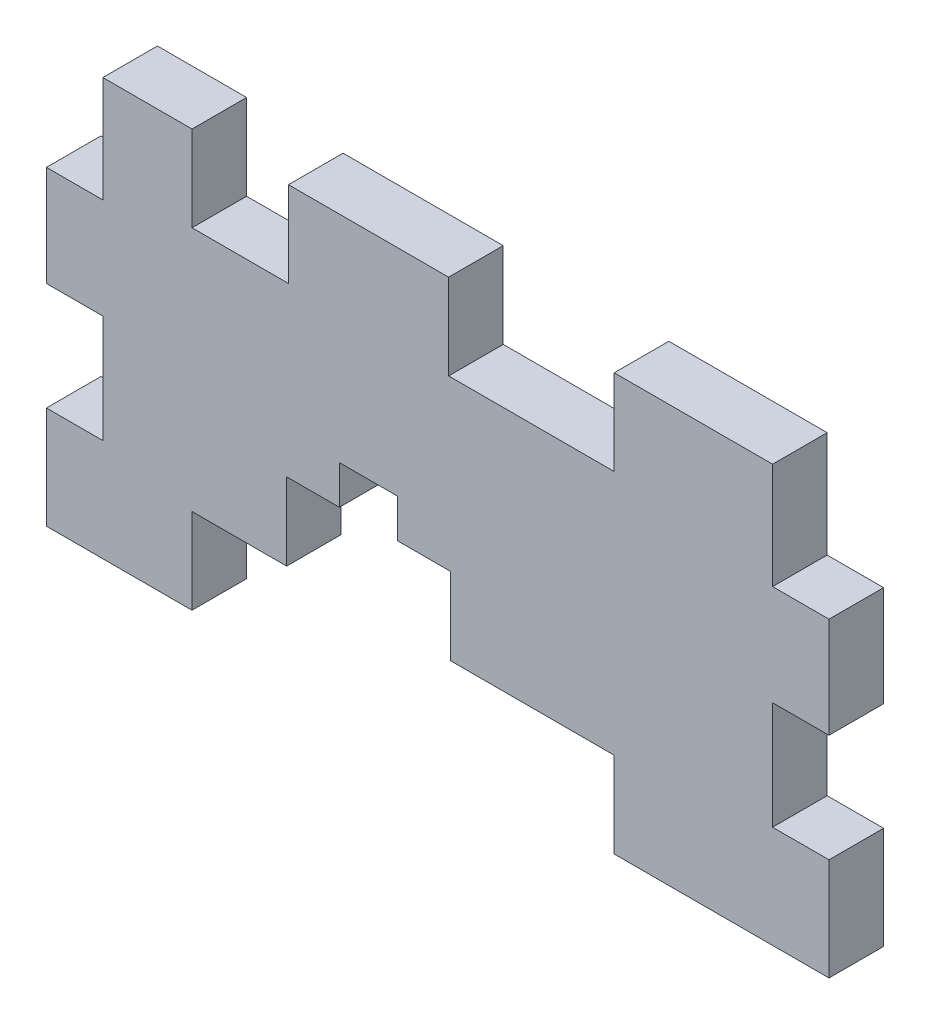
ISO-10303-21;
HEADER;
FILE_DESCRIPTION(('STEP AP214'),'2;1');
FILE_NAME('part.step','',(''),(''),'','','');
FILE_SCHEMA(('AUTOMOTIVE_DESIGN { 1 0 10303 214 1 1 1 1 }'));
ENDSEC;
DATA;
#1=APPLICATION_CONTEXT('core data for automotive mechanical design processes');
#2=APPLICATION_PROTOCOL_DEFINITION('international standard','automotive_design',2000,#1);
#3=PRODUCT_CONTEXT('',#1,'mechanical');
#4=PRODUCT('Part','Part','',(#3));
#5=PRODUCT_RELATED_PRODUCT_CATEGORY('part','',(#4));
#6=PRODUCT_DEFINITION_FORMATION('','',#4);
#7=PRODUCT_DEFINITION_CONTEXT('part definition',#1,'design');
#8=PRODUCT_DEFINITION('design','',#6,#7);
#9=PRODUCT_DEFINITION_SHAPE('','',#8);
#10=(LENGTH_UNIT() NAMED_UNIT(*) SI_UNIT(.MILLI.,.METRE.));
#11=(NAMED_UNIT(*) PLANE_ANGLE_UNIT() SI_UNIT($,.RADIAN.));
#12=(NAMED_UNIT(*) SI_UNIT($,.STERADIAN.) SOLID_ANGLE_UNIT());
#13=UNCERTAINTY_MEASURE_WITH_UNIT(LENGTH_MEASURE(1.E-05),#10,'distance_accuracy_value','');
#14=(GEOMETRIC_REPRESENTATION_CONTEXT(3) GLOBAL_UNCERTAINTY_ASSIGNED_CONTEXT((#13)) GLOBAL_UNIT_ASSIGNED_CONTEXT((#10,
#11,#12)) REPRESENTATION_CONTEXT('',''));
#15=CARTESIAN_POINT('',(0.,0.,0.));
#16=DIRECTION('',(0.,0.,1.));
#17=DIRECTION('',(1.,0.,0.));
#18=AXIS2_PLACEMENT_3D('',#15,#16,#17);
#19=CARTESIAN_POINT('',(0.,0.,2.99999999999996));
#20=DIRECTION('',(0.,0.,-1.));
#21=DIRECTION('',(-1.,0.,0.));
#22=AXIS2_PLACEMENT_3D('',#19,#20,#21);
#23=PLANE('',#22);
#24=DIRECTION('',(0.,-1.,0.));
#25=VECTOR('',#24,1.);
#26=CARTESIAN_POINT('',(-5.39999999999997,26.125,2.99999999999996));
#27=LINE('',#26,#25);
#28=CARTESIAN_POINT('',(-5.39999999999997,26.125,2.99999999999996));
#29=VERTEX_POINT('',#28);
#30=CARTESIAN_POINT('',(-5.39999999999997,24.,2.99999999999996));
#31=VERTEX_POINT('',#30);
#32=EDGE_CURVE('E277',#29,#31,#27,.T.);
#33=ORIENTED_EDGE('',*,*,#32,.F.);
#34=DIRECTION('',(-1.,0.,0.));
#35=VECTOR('',#34,1.);
#36=CARTESIAN_POINT('',(-2.19999999999997,26.125,2.99999999999996));
#37=LINE('',#36,#35);
#38=CARTESIAN_POINT('',(-2.19999999999997,26.125,2.99999999999996));
#39=VERTEX_POINT('',#38);
#40=EDGE_CURVE('E267',#39,#29,#37,.T.);
#41=ORIENTED_EDGE('',*,*,#40,.F.);
#42=DIRECTION('',(0.,1.,0.));
#43=VECTOR('',#42,1.);
#44=CARTESIAN_POINT('',(-2.19999999999997,23.9,2.99999999999996));
#45=LINE('',#44,#43);
#46=CARTESIAN_POINT('',(-2.19999999999997,24.,2.99999999999996));
#47=VERTEX_POINT('',#46);
#48=EDGE_CURVE('E289',#47,#39,#45,.T.);
#49=ORIENTED_EDGE('',*,*,#48,.F.);
#50=DIRECTION('',(1.,0.,0.));
#51=VECTOR('',#50,1.);
#52=CARTESIAN_POINT('',(0.700000000000004,24.,2.99999999999996));
#53=LINE('',#52,#51);
#54=CARTESIAN_POINT('',(0.700000000000004,24.,2.99999999999996));
#55=VERTEX_POINT('',#54);
#56=EDGE_CURVE('E445',#47,#55,#53,.T.);
#57=ORIENTED_EDGE('',*,*,#56,.T.);
#58=DIRECTION('',(0.,-1.,0.));
#59=VECTOR('',#58,1.);
#60=CARTESIAN_POINT('',(0.700000000000004,15.05,2.99999999999996));
#61=LINE('',#60,#59);
#62=CARTESIAN_POINT('',(0.700000000000004,19.75,2.99999999999996));
#63=VERTEX_POINT('',#62);
#64=EDGE_CURVE('E447',#55,#63,#61,.T.);
#65=ORIENTED_EDGE('',*,*,#64,.T.);
#66=DIRECTION('',(-1.,0.,0.));
#67=VECTOR('',#66,1.);
#68=CARTESIAN_POINT('',(9.70000000000001,19.75,2.99999999999996));
#69=LINE('',#68,#67);
#70=CARTESIAN_POINT('',(9.70000000000001,19.75,2.99999999999996));
#71=VERTEX_POINT('',#70);
#72=EDGE_CURVE('E374',#71,#63,#69,.T.);
#73=ORIENTED_EDGE('',*,*,#72,.F.);
#74=DIRECTION('',(0.,1.,0.));
#75=VECTOR('',#74,1.);
#76=CARTESIAN_POINT('',(9.70000000000001,14.95,2.99999999999996));
#77=LINE('',#76,#75);
#78=CARTESIAN_POINT('',(9.70000000000001,15.05,2.99999999999996));
#79=VERTEX_POINT('',#78);
#80=EDGE_CURVE('E370',#79,#71,#77,.T.);
#81=ORIENTED_EDGE('',*,*,#80,.F.);
#82=DIRECTION('',(1.,0.,0.));
#83=VECTOR('',#82,1.);
#84=CARTESIAN_POINT('',(21.5,15.05,2.99999999999996));
#85=LINE('',#84,#83);
#86=CARTESIAN_POINT('',(21.5,15.05,2.99999999999996));
#87=VERTEX_POINT('',#86);
#88=EDGE_CURVE('E450',#79,#87,#85,.T.);
#89=ORIENTED_EDGE('',*,*,#88,.T.);
#90=DIRECTION('',(0.,1.,0.));
#91=VECTOR('',#90,1.);
#92=CARTESIAN_POINT('',(21.5,37.95,2.99999999999996));
#93=LINE('',#92,#91);
#94=CARTESIAN_POINT('',(21.5,20.675,2.99999999999996));
#95=VERTEX_POINT('',#94);
#96=EDGE_CURVE('E428',#87,#95,#93,.T.);
#97=ORIENTED_EDGE('',*,*,#96,.T.);
#98=DIRECTION('',(1.,0.,0.));
#99=VECTOR('',#98,1.);
#100=CARTESIAN_POINT('',(18.4,20.675,2.99999999999996));
#101=LINE('',#100,#99);
#102=CARTESIAN_POINT('',(18.4,20.675,2.99999999999996));
#103=VERTEX_POINT('',#102);
#104=EDGE_CURVE('E413',#103,#95,#101,.T.);
#105=ORIENTED_EDGE('',*,*,#104,.F.);
#106=DIRECTION('',(0.,-1.,0.));
#107=VECTOR('',#106,1.);
#108=CARTESIAN_POINT('',(18.4,26.6,2.99999999999996));
#109=LINE('',#108,#107);
#110=CARTESIAN_POINT('',(18.4,26.6,2.99999999999996));
#111=VERTEX_POINT('',#110);
#112=EDGE_CURVE('E410',#111,#103,#109,.T.);
#113=ORIENTED_EDGE('',*,*,#112,.F.);
#114=DIRECTION('',(-1.,0.,0.));
#115=VECTOR('',#114,1.);
#116=CARTESIAN_POINT('',(21.6,26.6,2.99999999999996));
#117=LINE('',#116,#115);
#118=CARTESIAN_POINT('',(21.5,26.6,2.99999999999996));
#119=VERTEX_POINT('',#118);
#120=EDGE_CURVE('E408',#119,#111,#117,.T.);
#121=ORIENTED_EDGE('',*,*,#120,.F.);
#122=CARTESIAN_POINT('',(21.5,32.125,2.99999999999996));
#123=VERTEX_POINT('',#122);
#124=EDGE_CURVE('E432',#119,#123,#93,.T.);
#125=ORIENTED_EDGE('',*,*,#124,.T.);
#126=DIRECTION('',(1.,0.,0.));
#127=VECTOR('',#126,1.);
#128=CARTESIAN_POINT('',(18.4,32.125,2.99999999999996));
#129=LINE('',#128,#127);
#130=CARTESIAN_POINT('',(18.4,32.125,2.99999999999996));
#131=VERTEX_POINT('',#130);
#132=EDGE_CURVE('E396',#131,#123,#129,.T.);
#133=ORIENTED_EDGE('',*,*,#132,.F.);
#134=DIRECTION('',(0.,-1.,0.));
#135=VECTOR('',#134,1.);
#136=CARTESIAN_POINT('',(18.4,38.05,2.99999999999996));
#137=LINE('',#136,#135);
#138=CARTESIAN_POINT('',(18.4,37.95,2.99999999999996));
#139=VERTEX_POINT('',#138);
#140=EDGE_CURVE('E394',#139,#131,#137,.T.);
#141=ORIENTED_EDGE('',*,*,#140,.F.);
#142=DIRECTION('',(-1.,0.,0.));
#143=VECTOR('',#142,1.);
#144=CARTESIAN_POINT('',(21.5,37.95,2.99999999999996));
#145=LINE('',#144,#143);
#146=CARTESIAN_POINT('',(9.70000000000001,37.95,2.99999999999996));
#147=VERTEX_POINT('',#146);
#148=EDGE_CURVE('E433',#139,#147,#145,.T.);
#149=ORIENTED_EDGE('',*,*,#148,.T.);
#150=DIRECTION('',(0.,1.,0.));
#151=VECTOR('',#150,1.);
#152=CARTESIAN_POINT('',(9.70000000000001,33.25,2.99999999999996));
#153=LINE('',#152,#151);
#154=CARTESIAN_POINT('',(9.70000000000001,33.25,2.99999999999996));
#155=VERTEX_POINT('',#154);
#156=EDGE_CURVE('E351',#155,#147,#153,.T.);
#157=ORIENTED_EDGE('',*,*,#156,.F.);
#158=DIRECTION('',(1.,0.,0.));
#159=VECTOR('',#158,1.);
#160=CARTESIAN_POINT('',(0.600000000000004,33.25,2.99999999999996));
#161=LINE('',#160,#159);
#162=CARTESIAN_POINT('',(0.600000000000004,33.25,2.99999999999996));
#163=VERTEX_POINT('',#162);
#164=EDGE_CURVE('E356',#163,#155,#161,.T.);
#165=ORIENTED_EDGE('',*,*,#164,.F.);
#166=DIRECTION('',(0.,-1.,0.));
#167=VECTOR('',#166,1.);
#168=CARTESIAN_POINT('',(0.600000000000004,38.05,2.99999999999996));
#169=LINE('',#168,#167);
#170=CARTESIAN_POINT('',(0.600000000000004,37.95,2.99999999999996));
#171=VERTEX_POINT('',#170);
#172=EDGE_CURVE('E353',#171,#163,#169,.T.);
#173=ORIENTED_EDGE('',*,*,#172,.F.);
#174=CARTESIAN_POINT('',(-8.19999999999995,37.95,2.99999999999996));
#175=VERTEX_POINT('',#174);
#176=EDGE_CURVE('E437',#171,#175,#145,.T.);
#177=ORIENTED_EDGE('',*,*,#176,.T.);
#178=DIRECTION('',(0.,1.,0.));
#179=VECTOR('',#178,1.);
#180=CARTESIAN_POINT('',(-8.19999999999995,33.25,2.99999999999996));
#181=LINE('',#180,#179);
#182=CARTESIAN_POINT('',(-8.19999999999995,33.25,2.99999999999996));
#183=VERTEX_POINT('',#182);
#184=EDGE_CURVE('E56',#183,#175,#181,.T.);
#185=ORIENTED_EDGE('',*,*,#184,.F.);
#186=DIRECTION('',(1.,0.,0.));
#187=VECTOR('',#186,1.);
#188=CARTESIAN_POINT('',(-13.5,33.25,2.99999999999996));
#189=LINE('',#188,#187);
#190=CARTESIAN_POINT('',(-13.5,33.25,2.99999999999996));
#191=VERTEX_POINT('',#190);
#192=EDGE_CURVE('E300',#191,#183,#189,.T.);
#193=ORIENTED_EDGE('',*,*,#192,.F.);
#194=DIRECTION('',(0.,-1.,0.));
#195=VECTOR('',#194,1.);
#196=CARTESIAN_POINT('',(-13.5,38.05,2.99999999999996));
#197=LINE('',#196,#195);
#198=CARTESIAN_POINT('',(-13.5,37.95,2.99999999999996));
#199=VERTEX_POINT('',#198);
#200=EDGE_CURVE('E298',#199,#191,#197,.T.);
#201=ORIENTED_EDGE('',*,*,#200,.F.);
#202=CARTESIAN_POINT('',(-18.4,37.95,2.99999999999996));
#203=VERTEX_POINT('',#202);
#204=EDGE_CURVE('E431',#199,#203,#145,.T.);
#205=ORIENTED_EDGE('',*,*,#204,.T.);
#206=DIRECTION('',(0.,1.,0.));
#207=VECTOR('',#206,1.);
#208=CARTESIAN_POINT('',(-18.4,32.125,2.99999999999996));
#209=LINE('',#208,#207);
#210=CARTESIAN_POINT('',(-18.4,32.125,2.99999999999996));
#211=VERTEX_POINT('',#210);
#212=EDGE_CURVE('E319',#211,#203,#209,.T.);
#213=ORIENTED_EDGE('',*,*,#212,.F.);
#214=DIRECTION('',(1.,0.,0.));
#215=VECTOR('',#214,1.);
#216=CARTESIAN_POINT('',(-21.6,32.125,2.99999999999996));
#217=LINE('',#216,#215);
#218=CARTESIAN_POINT('',(-21.5,32.125,2.99999999999996));
#219=VERTEX_POINT('',#218);
#220=EDGE_CURVE('E317',#219,#211,#217,.T.);
#221=ORIENTED_EDGE('',*,*,#220,.F.);
#222=DIRECTION('',(0.,-1.,0.));
#223=VECTOR('',#222,1.);
#224=CARTESIAN_POINT('',(-21.5,37.95,2.99999999999996));
#225=LINE('',#224,#223);
#226=CARTESIAN_POINT('',(-21.5,26.6,2.99999999999996));
#227=VERTEX_POINT('',#226);
#228=EDGE_CURVE('E438',#219,#227,#225,.T.);
#229=ORIENTED_EDGE('',*,*,#228,.T.);
#230=DIRECTION('',(-1.,0.,0.));
#231=VECTOR('',#230,1.);
#232=CARTESIAN_POINT('',(-18.4,26.6,2.99999999999996));
#233=LINE('',#232,#231);
#234=CARTESIAN_POINT('',(-18.4,26.6,2.99999999999996));
#235=VERTEX_POINT('',#234);
#236=EDGE_CURVE('E332',#235,#227,#233,.T.);
#237=ORIENTED_EDGE('',*,*,#236,.F.);
#238=DIRECTION('',(0.,1.,0.));
#239=VECTOR('',#238,1.);
#240=CARTESIAN_POINT('',(-18.4,20.675,2.99999999999996));
#241=LINE('',#240,#239);
#242=CARTESIAN_POINT('',(-18.4,20.675,2.99999999999996));
#243=VERTEX_POINT('',#242);
#244=EDGE_CURVE('E330',#243,#235,#241,.T.);
#245=ORIENTED_EDGE('',*,*,#244,.F.);
#246=DIRECTION('',(1.,0.,0.));
#247=VECTOR('',#246,1.);
#248=CARTESIAN_POINT('',(-21.6,20.675,2.99999999999996));
#249=LINE('',#248,#247);
#250=CARTESIAN_POINT('',(-21.5,20.675,2.99999999999996));
#251=VERTEX_POINT('',#250);
#252=EDGE_CURVE('E336',#251,#243,#249,.T.);
#253=ORIENTED_EDGE('',*,*,#252,.F.);
#254=CARTESIAN_POINT('',(-21.5,15.05,2.99999999999996));
#255=VERTEX_POINT('',#254);
#256=EDGE_CURVE('E436',#251,#255,#225,.T.);
#257=ORIENTED_EDGE('',*,*,#256,.T.);
#258=DIRECTION('',(1.,0.,0.));
#259=VECTOR('',#258,1.);
#260=CARTESIAN_POINT('',(-8.29999999999995,15.05,2.99999999999996));
#261=LINE('',#260,#259);
#262=CARTESIAN_POINT('',(-13.5,15.05,2.99999999999996));
#263=VERTEX_POINT('',#262);
#264=EDGE_CURVE('E440',#255,#263,#261,.T.);
#265=ORIENTED_EDGE('',*,*,#264,.T.);
#266=DIRECTION('',(0.,-1.,0.));
#267=VECTOR('',#266,1.);
#268=CARTESIAN_POINT('',(-13.5,19.75,2.99999999999996));
#269=LINE('',#268,#267);
#270=CARTESIAN_POINT('',(-13.5,19.75,2.99999999999996));
#271=VERTEX_POINT('',#270);
#272=EDGE_CURVE('E376',#271,#263,#269,.T.);
#273=ORIENTED_EDGE('',*,*,#272,.F.);
#274=CARTESIAN_POINT('',(-8.29999999999995,19.75,2.99999999999996));
#275=VERTEX_POINT('',#274);
#276=EDGE_CURVE('E372',#275,#271,#69,.T.);
#277=ORIENTED_EDGE('',*,*,#276,.F.);
#278=DIRECTION('',(0.,1.,0.));
#279=VECTOR('',#278,1.);
#280=CARTESIAN_POINT('',(-8.29999999999995,24.,2.99999999999996));
#281=LINE('',#280,#279);
#282=CARTESIAN_POINT('',(-8.29999999999995,24.,2.99999999999996));
#283=VERTEX_POINT('',#282);
#284=EDGE_CURVE('E443',#275,#283,#281,.T.);
#285=ORIENTED_EDGE('',*,*,#284,.T.);
#286=EDGE_CURVE('E288',#283,#31,#53,.T.);
#287=ORIENTED_EDGE('',*,*,#286,.T.);
#288=EDGE_LOOP('',(#33,#41,#49,#57,#65,#73,#81,#89,#97,#105,#113,#121,#125,#133,#141,#149,#157,
#165,#173,#177,#185,#193,#201,#205,#213,#221,#229,#237,#245,#253,#257,#265,#273,#277,#285,#287));
#289=FACE_BOUND('',#288,.T.);
#290=ADVANCED_FACE('F33',(#289),#23,.F.);
#291=CARTESIAN_POINT('',(0.,0.,0.));
#292=DIRECTION('',(0.,0.,-1.));
#293=DIRECTION('',(-1.,0.,0.));
#294=AXIS2_PLACEMENT_3D('',#291,#292,#293);
#295=PLANE('',#294);
#296=DIRECTION('',(-1.,0.,0.));
#297=VECTOR('',#296,1.);
#298=CARTESIAN_POINT('',(-2.19999999999997,26.125,0.));
#299=LINE('',#298,#297);
#300=CARTESIAN_POINT('',(-2.19999999999997,26.125,0.));
#301=VERTEX_POINT('',#300);
#302=CARTESIAN_POINT('',(-5.39999999999997,26.125,0.));
#303=VERTEX_POINT('',#302);
#304=EDGE_CURVE('E293',#301,#303,#299,.T.);
#305=ORIENTED_EDGE('',*,*,#304,.T.);
#306=DIRECTION('',(0.,-1.,0.));
#307=VECTOR('',#306,1.);
#308=CARTESIAN_POINT('',(-5.39999999999997,26.125,0.));
#309=LINE('',#308,#307);
#310=CARTESIAN_POINT('',(-5.39999999999997,24.,0.));
#311=VERTEX_POINT('',#310);
#312=EDGE_CURVE('E283',#303,#311,#309,.T.);
#313=ORIENTED_EDGE('',*,*,#312,.T.);
#314=DIRECTION('',(1.,0.,0.));
#315=VECTOR('',#314,1.);
#316=CARTESIAN_POINT('',(0.700000000000004,24.,0.));
#317=LINE('',#316,#315);
#318=CARTESIAN_POINT('',(-8.29999999999995,24.,0.));
#319=VERTEX_POINT('',#318);
#320=EDGE_CURVE('E470',#319,#311,#317,.T.);
#321=ORIENTED_EDGE('',*,*,#320,.F.);
#322=DIRECTION('',(0.,1.,0.));
#323=VECTOR('',#322,1.);
#324=CARTESIAN_POINT('',(-8.29999999999995,24.,0.));
#325=LINE('',#324,#323);
#326=CARTESIAN_POINT('',(-8.29999999999995,19.75,0.));
#327=VERTEX_POINT('',#326);
#328=EDGE_CURVE('E467',#327,#319,#325,.T.);
#329=ORIENTED_EDGE('',*,*,#328,.F.);
#330=DIRECTION('',(-1.,0.,0.));
#331=VECTOR('',#330,1.);
#332=CARTESIAN_POINT('',(9.70000000000001,19.75,0.));
#333=LINE('',#332,#331);
#334=CARTESIAN_POINT('',(-13.5,19.75,0.));
#335=VERTEX_POINT('',#334);
#336=EDGE_CURVE('E381',#327,#335,#333,.T.);
#337=ORIENTED_EDGE('',*,*,#336,.T.);
#338=DIRECTION('',(0.,-1.,0.));
#339=VECTOR('',#338,1.);
#340=CARTESIAN_POINT('',(-13.5,19.75,0.));
#341=LINE('',#340,#339);
#342=CARTESIAN_POINT('',(-13.5,15.05,0.));
#343=VERTEX_POINT('',#342);
#344=EDGE_CURVE('E373',#335,#343,#341,.T.);
#345=ORIENTED_EDGE('',*,*,#344,.T.);
#346=DIRECTION('',(1.,0.,0.));
#347=VECTOR('',#346,1.);
#348=CARTESIAN_POINT('',(-8.29999999999995,15.05,0.));
#349=LINE('',#348,#347);
#350=CARTESIAN_POINT('',(-21.5,15.05,0.));
#351=VERTEX_POINT('',#350);
#352=EDGE_CURVE('E464',#351,#343,#349,.T.);
#353=ORIENTED_EDGE('',*,*,#352,.F.);
#354=DIRECTION('',(0.,-1.,0.));
#355=VECTOR('',#354,1.);
#356=CARTESIAN_POINT('',(-21.5,37.95,0.));
#357=LINE('',#356,#355);
#358=CARTESIAN_POINT('',(-21.5,20.675,0.));
#359=VERTEX_POINT('',#358);
#360=EDGE_CURVE('E460',#359,#351,#357,.T.);
#361=ORIENTED_EDGE('',*,*,#360,.F.);
#362=DIRECTION('',(1.,0.,0.));
#363=VECTOR('',#362,1.);
#364=CARTESIAN_POINT('',(-21.6,20.675,0.));
#365=LINE('',#364,#363);
#366=CARTESIAN_POINT('',(-18.4,20.675,0.));
#367=VERTEX_POINT('',#366);
#368=EDGE_CURVE('E333',#359,#367,#365,.T.);
#369=ORIENTED_EDGE('',*,*,#368,.T.);
#370=DIRECTION('',(0.,1.,0.));
#371=VECTOR('',#370,1.);
#372=CARTESIAN_POINT('',(-18.4,20.675,0.));
#373=LINE('',#372,#371);
#374=CARTESIAN_POINT('',(-18.4,26.6,0.));
#375=VERTEX_POINT('',#374);
#376=EDGE_CURVE('E329',#367,#375,#373,.T.);
#377=ORIENTED_EDGE('',*,*,#376,.T.);
#378=DIRECTION('',(-1.,0.,0.));
#379=VECTOR('',#378,1.);
#380=CARTESIAN_POINT('',(-18.4,26.6,0.));
#381=LINE('',#380,#379);
#382=CARTESIAN_POINT('',(-21.5,26.6,0.));
#383=VERTEX_POINT('',#382);
#384=EDGE_CURVE('E341',#375,#383,#381,.T.);
#385=ORIENTED_EDGE('',*,*,#384,.T.);
#386=CARTESIAN_POINT('',(-21.5,32.125,0.));
#387=VERTEX_POINT('',#386);
#388=EDGE_CURVE('E462',#387,#383,#357,.T.);
#389=ORIENTED_EDGE('',*,*,#388,.F.);
#390=DIRECTION('',(1.,0.,0.));
#391=VECTOR('',#390,1.);
#392=CARTESIAN_POINT('',(-21.6,32.125,0.));
#393=LINE('',#392,#391);
#394=CARTESIAN_POINT('',(-18.4,32.125,0.));
#395=VERTEX_POINT('',#394);
#396=EDGE_CURVE('E316',#387,#395,#393,.T.);
#397=ORIENTED_EDGE('',*,*,#396,.T.);
#398=DIRECTION('',(0.,1.,0.));
#399=VECTOR('',#398,1.);
#400=CARTESIAN_POINT('',(-18.4,32.125,0.));
#401=LINE('',#400,#399);
#402=CARTESIAN_POINT('',(-18.4,37.95,0.));
#403=VERTEX_POINT('',#402);
#404=EDGE_CURVE('E320',#395,#403,#401,.T.);
#405=ORIENTED_EDGE('',*,*,#404,.T.);
#406=DIRECTION('',(-1.,0.,0.));
#407=VECTOR('',#406,1.);
#408=CARTESIAN_POINT('',(21.5,37.95,0.));
#409=LINE('',#408,#407);
#410=CARTESIAN_POINT('',(-13.5,37.95,0.));
#411=VERTEX_POINT('',#410);
#412=EDGE_CURVE('E456',#411,#403,#409,.T.);
#413=ORIENTED_EDGE('',*,*,#412,.F.);
#414=DIRECTION('',(0.,-1.,0.));
#415=VECTOR('',#414,1.);
#416=CARTESIAN_POINT('',(-13.5,38.05,0.));
#417=LINE('',#416,#415);
#418=CARTESIAN_POINT('',(-13.5,33.25,0.));
#419=VERTEX_POINT('',#418);
#420=EDGE_CURVE('E284',#411,#419,#417,.T.);
#421=ORIENTED_EDGE('',*,*,#420,.T.);
#422=DIRECTION('',(1.,0.,0.));
#423=VECTOR('',#422,1.);
#424=CARTESIAN_POINT('',(-13.5,33.25,0.));
#425=LINE('',#424,#423);
#426=CARTESIAN_POINT('',(-8.19999999999995,33.25,0.));
#427=VERTEX_POINT('',#426);
#428=EDGE_CURVE('E307',#419,#427,#425,.T.);
#429=ORIENTED_EDGE('',*,*,#428,.T.);
#430=DIRECTION('',(0.,1.,0.));
#431=VECTOR('',#430,1.);
#432=CARTESIAN_POINT('',(-8.19999999999995,33.25,0.));
#433=LINE('',#432,#431);
#434=CARTESIAN_POINT('',(-8.19999999999995,37.95,0.));
#435=VERTEX_POINT('',#434);
#436=EDGE_CURVE('E301',#427,#435,#433,.T.);
#437=ORIENTED_EDGE('',*,*,#436,.T.);
#438=CARTESIAN_POINT('',(0.600000000000007,37.95,0.));
#439=VERTEX_POINT('',#438);
#440=EDGE_CURVE('E461',#439,#435,#409,.T.);
#441=ORIENTED_EDGE('',*,*,#440,.F.);
#442=DIRECTION('',(0.,-1.,0.));
#443=VECTOR('',#442,1.);
#444=CARTESIAN_POINT('',(0.600000000000004,38.05,0.));
#445=LINE('',#444,#443);
#446=CARTESIAN_POINT('',(0.600000000000004,33.25,0.));
#447=VERTEX_POINT('',#446);
#448=EDGE_CURVE('E361',#439,#447,#445,.T.);
#449=ORIENTED_EDGE('',*,*,#448,.T.);
#450=DIRECTION('',(1.,0.,0.));
#451=VECTOR('',#450,1.);
#452=CARTESIAN_POINT('',(0.600000000000004,33.25,0.));
#453=LINE('',#452,#451);
#454=CARTESIAN_POINT('',(9.70000000000001,33.25,0.));
#455=VERTEX_POINT('',#454);
#456=EDGE_CURVE('E354',#447,#455,#453,.T.);
#457=ORIENTED_EDGE('',*,*,#456,.T.);
#458=DIRECTION('',(0.,1.,0.));
#459=VECTOR('',#458,1.);
#460=CARTESIAN_POINT('',(9.70000000000001,33.25,0.));
#461=LINE('',#460,#459);
#462=CARTESIAN_POINT('',(9.70000000000001,37.95,0.));
#463=VERTEX_POINT('',#462);
#464=EDGE_CURVE('E350',#455,#463,#461,.T.);
#465=ORIENTED_EDGE('',*,*,#464,.T.);
#466=CARTESIAN_POINT('',(18.4,37.95,0.));
#467=VERTEX_POINT('',#466);
#468=EDGE_CURVE('E457',#467,#463,#409,.T.);
#469=ORIENTED_EDGE('',*,*,#468,.F.);
#470=DIRECTION('',(0.,-1.,0.));
#471=VECTOR('',#470,1.);
#472=CARTESIAN_POINT('',(18.4,38.05,0.));
#473=LINE('',#472,#471);
#474=CARTESIAN_POINT('',(18.4,32.125,0.));
#475=VERTEX_POINT('',#474);
#476=EDGE_CURVE('E393',#467,#475,#473,.T.);
#477=ORIENTED_EDGE('',*,*,#476,.T.);
#478=DIRECTION('',(1.,0.,0.));
#479=VECTOR('',#478,1.);
#480=CARTESIAN_POINT('',(18.4,32.125,0.));
#481=LINE('',#480,#479);
#482=CARTESIAN_POINT('',(21.5,32.125,0.));
#483=VERTEX_POINT('',#482);
#484=EDGE_CURVE('E397',#475,#483,#481,.T.);
#485=ORIENTED_EDGE('',*,*,#484,.T.);
#486=DIRECTION('',(0.,1.,0.));
#487=VECTOR('',#486,1.);
#488=CARTESIAN_POINT('',(21.5,37.95,0.));
#489=LINE('',#488,#487);
#490=CARTESIAN_POINT('',(21.5,26.6,0.));
#491=VERTEX_POINT('',#490);
#492=EDGE_CURVE('E427',#491,#483,#489,.T.);
#493=ORIENTED_EDGE('',*,*,#492,.F.);
#494=DIRECTION('',(-1.,0.,0.));
#495=VECTOR('',#494,1.);
#496=CARTESIAN_POINT('',(0.,26.6,0.));
#497=LINE('',#496,#495);
#498=CARTESIAN_POINT('',(18.4,26.6,0.));
#499=VERTEX_POINT('',#498);
#500=EDGE_CURVE('E489',#491,#499,#497,.T.);
#501=ORIENTED_EDGE('',*,*,#500,.T.);
#502=DIRECTION('',(0.,-1.,0.));
#503=VECTOR('',#502,1.);
#504=CARTESIAN_POINT('',(18.4,26.6,0.));
#505=LINE('',#504,#503);
#506=CARTESIAN_POINT('',(18.4,20.675,0.));
#507=VERTEX_POINT('',#506);
#508=EDGE_CURVE('E407',#499,#507,#505,.T.);
#509=ORIENTED_EDGE('',*,*,#508,.T.);
#510=DIRECTION('',(1.,0.,0.));
#511=VECTOR('',#510,1.);
#512=CARTESIAN_POINT('',(18.4,20.675,0.));
#513=LINE('',#512,#511);
#514=CARTESIAN_POINT('',(21.5,20.675,0.));
#515=VERTEX_POINT('',#514);
#516=EDGE_CURVE('E411',#507,#515,#513,.T.);
#517=ORIENTED_EDGE('',*,*,#516,.T.);
#518=CARTESIAN_POINT('',(21.5,15.05,0.));
#519=VERTEX_POINT('',#518);
#520=EDGE_CURVE('E453',#519,#515,#489,.T.);
#521=ORIENTED_EDGE('',*,*,#520,.F.);
#522=DIRECTION('',(1.,0.,0.));
#523=VECTOR('',#522,1.);
#524=CARTESIAN_POINT('',(21.5,15.05,0.));
#525=LINE('',#524,#523);
#526=CARTESIAN_POINT('',(9.70000000000001,15.05,0.));
#527=VERTEX_POINT('',#526);
#528=EDGE_CURVE('E476',#527,#519,#525,.T.);
#529=ORIENTED_EDGE('',*,*,#528,.F.);
#530=DIRECTION('',(0.,1.,0.));
#531=VECTOR('',#530,1.);
#532=CARTESIAN_POINT('',(9.70000000000001,14.95,0.));
#533=LINE('',#532,#531);
#534=CARTESIAN_POINT('',(9.70000000000001,19.75,0.));
#535=VERTEX_POINT('',#534);
#536=EDGE_CURVE('E369',#527,#535,#533,.T.);
#537=ORIENTED_EDGE('',*,*,#536,.T.);
#538=CARTESIAN_POINT('',(0.700000000000004,19.75,0.));
#539=VERTEX_POINT('',#538);
#540=EDGE_CURVE('E382',#535,#539,#333,.T.);
#541=ORIENTED_EDGE('',*,*,#540,.T.);
#542=DIRECTION('',(0.,-1.,0.));
#543=VECTOR('',#542,1.);
#544=CARTESIAN_POINT('',(0.700000000000004,15.05,0.));
#545=LINE('',#544,#543);
#546=CARTESIAN_POINT('',(0.700000000000004,24.,0.));
#547=VERTEX_POINT('',#546);
#548=EDGE_CURVE('E473',#547,#539,#545,.T.);
#549=ORIENTED_EDGE('',*,*,#548,.F.);
#550=CARTESIAN_POINT('',(-2.19999999999997,24.,0.));
#551=VERTEX_POINT('',#550);
#552=EDGE_CURVE('E469',#551,#547,#317,.T.);
#553=ORIENTED_EDGE('',*,*,#552,.F.);
#554=DIRECTION('',(0.,1.,0.));
#555=VECTOR('',#554,1.);
#556=CARTESIAN_POINT('',(-2.19999999999997,23.9,0.));
#557=LINE('',#556,#555);
#558=EDGE_CURVE('E48',#551,#301,#557,.T.);
#559=ORIENTED_EDGE('',*,*,#558,.T.);
#560=EDGE_LOOP('',(#305,#313,#321,#329,#337,#345,#353,#361,#369,#377,#385,#389,#397,#405,#413,
#421,#429,#437,#441,#449,#457,#465,#469,#477,#485,#493,#501,#509,#517,#521,#529,#537,#541,#549,
#553,#559));
#561=FACE_BOUND('',#560,.T.);
#562=ADVANCED_FACE('F539',(#561),#295,.T.);
#563=CARTESIAN_POINT('',(0.700000000000004,24.,2.99999999999996));
#564=DIRECTION('',(0.,1.,0.));
#565=DIRECTION('',(0.,0.,1.));
#566=AXIS2_PLACEMENT_3D('',#563,#564,#565);
#567=PLANE('',#566);
#568=DIRECTION('',(0.,0.,-1.));
#569=VECTOR('',#568,1.);
#570=CARTESIAN_POINT('',(-5.39999999999997,24.,2.99999999999996));
#571=LINE('',#570,#569);
#572=EDGE_CURVE('E11',#31,#311,#571,.T.);
#573=ORIENTED_EDGE('',*,*,#572,.F.);
#574=ORIENTED_EDGE('',*,*,#286,.F.);
#575=DIRECTION('',(0.,0.,-1.));
#576=VECTOR('',#575,1.);
#577=CARTESIAN_POINT('',(-8.29999999999995,24.,2.99999999999996));
#578=LINE('',#577,#576);
#579=EDGE_CURVE('E483',#283,#319,#578,.T.);
#580=ORIENTED_EDGE('',*,*,#579,.T.);
#581=ORIENTED_EDGE('',*,*,#320,.T.);
#582=EDGE_LOOP('',(#573,#574,#580,#581));
#583=FACE_BOUND('',#582,.T.);
#584=ADVANCED_FACE('F638',(#583),#567,.F.);
#585=DIRECTION('',(0.,0.,1.));
#586=VECTOR('',#585,1.);
#587=CARTESIAN_POINT('',(-2.19999999999997,24.,2.99999999999996));
#588=LINE('',#587,#586);
#589=EDGE_CURVE('E41',#551,#47,#588,.T.);
#590=ORIENTED_EDGE('',*,*,#589,.F.);
#591=ORIENTED_EDGE('',*,*,#552,.T.);
#592=DIRECTION('',(0.,0.,-1.));
#593=VECTOR('',#592,1.);
#594=CARTESIAN_POINT('',(0.700000000000004,24.,2.99999999999996));
#595=LINE('',#594,#593);
#596=EDGE_CURVE('E480',#55,#547,#595,.T.);
#597=ORIENTED_EDGE('',*,*,#596,.F.);
#598=ORIENTED_EDGE('',*,*,#56,.F.);
#599=EDGE_LOOP('',(#590,#591,#597,#598));
#600=FACE_BOUND('',#599,.T.);
#601=ADVANCED_FACE('F522',(#600),#567,.F.);
#602=CARTESIAN_POINT('',(21.5,37.95,2.99999999999996));
#603=DIRECTION('',(0.,-1.,0.));
#604=DIRECTION('',(1.,0.,0.));
#605=AXIS2_PLACEMENT_3D('',#602,#603,#604);
#606=PLANE('',#605);
#607=DIRECTION('',(0.,0.,1.));
#608=VECTOR('',#607,1.);
#609=CARTESIAN_POINT('',(-13.5,37.95,2.99999999999996));
#610=LINE('',#609,#608);
#611=EDGE_CURVE('E516',#411,#199,#610,.T.);
#612=ORIENTED_EDGE('',*,*,#611,.F.);
#613=ORIENTED_EDGE('',*,*,#412,.T.);
#614=DIRECTION('',(0.,0.,-1.));
#615=VECTOR('',#614,1.);
#616=CARTESIAN_POINT('',(-18.4,37.95,2.99999999999996));
#617=LINE('',#616,#615);
#618=EDGE_CURVE('E509',#203,#403,#617,.T.);
#619=ORIENTED_EDGE('',*,*,#618,.F.);
#620=ORIENTED_EDGE('',*,*,#204,.F.);
#621=EDGE_LOOP('',(#612,#613,#619,#620));
#622=FACE_BOUND('',#621,.T.);
#623=ADVANCED_FACE('F614',(#622),#606,.F.);
#624=DIRECTION('',(0.,0.,-1.));
#625=VECTOR('',#624,1.);
#626=CARTESIAN_POINT('',(-8.19999999999995,37.95,2.99999999999996));
#627=LINE('',#626,#625);
#628=EDGE_CURVE('E514',#175,#435,#627,.T.);
#629=ORIENTED_EDGE('',*,*,#628,.F.);
#630=ORIENTED_EDGE('',*,*,#176,.F.);
#631=DIRECTION('',(0.,0.,1.));
#632=VECTOR('',#631,1.);
#633=CARTESIAN_POINT('',(0.600000000000003,37.95,2.99999999999996));
#634=LINE('',#633,#632);
#635=EDGE_CURVE('E500',#439,#171,#634,.T.);
#636=ORIENTED_EDGE('',*,*,#635,.F.);
#637=ORIENTED_EDGE('',*,*,#440,.T.);
#638=EDGE_LOOP('',(#629,#630,#636,#637));
#639=FACE_BOUND('',#638,.T.);
#640=ADVANCED_FACE('F599',(#639),#606,.F.);
#641=CARTESIAN_POINT('',(-21.5,37.95,2.99999999999996));
#642=DIRECTION('',(1.,0.,0.));
#643=DIRECTION('',(0.,1.,0.));
#644=AXIS2_PLACEMENT_3D('',#641,#642,#643);
#645=PLANE('',#644);
#646=DIRECTION('',(0.,0.,1.));
#647=VECTOR('',#646,1.);
#648=CARTESIAN_POINT('',(-21.5,32.125,2.99999999999996));
#649=LINE('',#648,#647);
#650=EDGE_CURVE('E512',#387,#219,#649,.T.);
#651=ORIENTED_EDGE('',*,*,#650,.F.);
#652=ORIENTED_EDGE('',*,*,#388,.T.);
#653=DIRECTION('',(0.,0.,-1.));
#654=VECTOR('',#653,1.);
#655=CARTESIAN_POINT('',(-21.5,26.6,2.99999999999996));
#656=LINE('',#655,#654);
#657=EDGE_CURVE('E506',#227,#383,#656,.T.);
#658=ORIENTED_EDGE('',*,*,#657,.F.);
#659=ORIENTED_EDGE('',*,*,#228,.F.);
#660=EDGE_LOOP('',(#651,#652,#658,#659));
#661=FACE_BOUND('',#660,.T.);
#662=ADVANCED_FACE('F658',(#661),#645,.F.);
#663=DIRECTION('',(0.,0.,1.));
#664=VECTOR('',#663,1.);
#665=CARTESIAN_POINT('',(-21.5,20.675,2.99999999999996));
#666=LINE('',#665,#664);
#667=EDGE_CURVE('E504',#359,#251,#666,.T.);
#668=ORIENTED_EDGE('',*,*,#667,.F.);
#669=ORIENTED_EDGE('',*,*,#360,.T.);
#670=DIRECTION('',(0.,0.,-1.));
#671=VECTOR('',#670,1.);
#672=CARTESIAN_POINT('',(-21.5,15.05,2.99999999999996));
#673=LINE('',#672,#671);
#674=EDGE_CURVE('E486',#255,#351,#673,.T.);
#675=ORIENTED_EDGE('',*,*,#674,.F.);
#676=ORIENTED_EDGE('',*,*,#256,.F.);
#677=EDGE_LOOP('',(#668,#669,#675,#676));
#678=FACE_BOUND('',#677,.T.);
#679=ADVANCED_FACE('F660',(#678),#645,.F.);
#680=DIRECTION('',(0.,0.,-1.));
#681=VECTOR('',#680,1.);
#682=CARTESIAN_POINT('',(9.70000000000001,37.95,2.99999999999996));
#683=LINE('',#682,#681);
#684=EDGE_CURVE('E502',#147,#463,#683,.T.);
#685=ORIENTED_EDGE('',*,*,#684,.F.);
#686=ORIENTED_EDGE('',*,*,#148,.F.);
#687=DIRECTION('',(0.,0.,1.));
#688=VECTOR('',#687,1.);
#689=CARTESIAN_POINT('',(18.4,37.95,2.99999999999996));
#690=LINE('',#689,#688);
#691=EDGE_CURVE('E492',#467,#139,#690,.T.);
#692=ORIENTED_EDGE('',*,*,#691,.F.);
#693=ORIENTED_EDGE('',*,*,#468,.T.);
#694=EDGE_LOOP('',(#685,#686,#692,#693));
#695=FACE_BOUND('',#694,.T.);
#696=ADVANCED_FACE('F581',(#695),#606,.F.);
#697=CARTESIAN_POINT('',(-8.29999999999995,15.05,2.99999999999996));
#698=DIRECTION('',(0.,1.,0.));
#699=DIRECTION('',(-1.,0.,0.));
#700=AXIS2_PLACEMENT_3D('',#697,#698,#699);
#701=PLANE('',#700);
#702=DIRECTION('',(0.,0.,-1.));
#703=VECTOR('',#702,1.);
#704=CARTESIAN_POINT('',(-13.5,15.05,2.99999999999996));
#705=LINE('',#704,#703);
#706=EDGE_CURVE('E498',#263,#343,#705,.T.);
#707=ORIENTED_EDGE('',*,*,#706,.F.);
#708=ORIENTED_EDGE('',*,*,#264,.F.);
#709=ORIENTED_EDGE('',*,*,#674,.T.);
#710=ORIENTED_EDGE('',*,*,#352,.T.);
#711=EDGE_LOOP('',(#707,#708,#709,#710));
#712=FACE_BOUND('',#711,.T.);
#713=ADVANCED_FACE('F653',(#712),#701,.F.);
#714=CARTESIAN_POINT('',(-8.29999999999995,24.,2.99999999999996));
#715=DIRECTION('',(-1.,0.,0.));
#716=DIRECTION('',(0.,0.,1.));
#717=AXIS2_PLACEMENT_3D('',#714,#715,#716);
#718=PLANE('',#717);
#719=DIRECTION('',(0.,0.,1.));
#720=VECTOR('',#719,1.);
#721=CARTESIAN_POINT('',(-8.29999999999995,19.75,2.99999999999996));
#722=LINE('',#721,#720);
#723=EDGE_CURVE('E391',#327,#275,#722,.T.);
#724=ORIENTED_EDGE('',*,*,#723,.F.);
#725=ORIENTED_EDGE('',*,*,#328,.T.);
#726=ORIENTED_EDGE('',*,*,#579,.F.);
#727=ORIENTED_EDGE('',*,*,#284,.F.);
#728=EDGE_LOOP('',(#724,#725,#726,#727));
#729=FACE_BOUND('',#728,.T.);
#730=ADVANCED_FACE('F647',(#729),#718,.F.);
#731=CARTESIAN_POINT('',(0.700000000000004,15.05,2.99999999999996));
#732=DIRECTION('',(1.,0.,0.));
#733=DIRECTION('',(0.,1.,0.));
#734=AXIS2_PLACEMENT_3D('',#731,#732,#733);
#735=PLANE('',#734);
#736=DIRECTION('',(0.,0.,-1.));
#737=VECTOR('',#736,1.);
#738=CARTESIAN_POINT('',(0.700000000000004,19.75,2.99999999999996));
#739=LINE('',#738,#737);
#740=EDGE_CURVE('E496',#63,#539,#739,.T.);
#741=ORIENTED_EDGE('',*,*,#740,.F.);
#742=ORIENTED_EDGE('',*,*,#64,.F.);
#743=ORIENTED_EDGE('',*,*,#596,.T.);
#744=ORIENTED_EDGE('',*,*,#548,.T.);
#745=EDGE_LOOP('',(#741,#742,#743,#744));
#746=FACE_BOUND('',#745,.T.);
#747=ADVANCED_FACE('F527',(#746),#735,.F.);
#748=CARTESIAN_POINT('',(21.5,15.05,2.99999999999996));
#749=DIRECTION('',(0.,1.,0.));
#750=DIRECTION('',(0.,0.,1.));
#751=AXIS2_PLACEMENT_3D('',#748,#749,#750);
#752=PLANE('',#751);
#753=DIRECTION('',(0.,0.,1.));
#754=VECTOR('',#753,1.);
#755=CARTESIAN_POINT('',(9.70000000000001,15.05,2.99999999999996));
#756=LINE('',#755,#754);
#757=EDGE_CURVE('E494',#527,#79,#756,.T.);
#758=ORIENTED_EDGE('',*,*,#757,.F.);
#759=ORIENTED_EDGE('',*,*,#528,.T.);
#760=DIRECTION('',(0.,0.,-1.));
#761=VECTOR('',#760,1.);
#762=CARTESIAN_POINT('',(21.5,15.05,2.99999999999996));
#763=LINE('',#762,#761);
#764=EDGE_CURVE('E452',#87,#519,#763,.T.);
#765=ORIENTED_EDGE('',*,*,#764,.F.);
#766=ORIENTED_EDGE('',*,*,#88,.F.);
#767=EDGE_LOOP('',(#758,#759,#765,#766));
#768=FACE_BOUND('',#767,.T.);
#769=ADVANCED_FACE('F543',(#768),#752,.F.);
#770=CARTESIAN_POINT('',(21.5,37.95,2.99999999999996));
#771=DIRECTION('',(-1.,0.,0.));
#772=DIRECTION('',(0.,-1.,0.));
#773=AXIS2_PLACEMENT_3D('',#770,#771,#772);
#774=PLANE('',#773);
#775=DIRECTION('',(0.,0.,-1.));
#776=VECTOR('',#775,1.);
#777=CARTESIAN_POINT('',(21.5,32.125,2.99999999999996));
#778=LINE('',#777,#776);
#779=EDGE_CURVE('E405',#123,#483,#778,.T.);
#780=ORIENTED_EDGE('',*,*,#779,.F.);
#781=ORIENTED_EDGE('',*,*,#124,.F.);
#782=DIRECTION('',(0.,0.,1.));
#783=VECTOR('',#782,1.);
#784=CARTESIAN_POINT('',(21.5,26.6,2.99999999999996));
#785=LINE('',#784,#783);
#786=EDGE_CURVE('E425',#491,#119,#785,.T.);
#787=ORIENTED_EDGE('',*,*,#786,.F.);
#788=ORIENTED_EDGE('',*,*,#492,.T.);
#789=EDGE_LOOP('',(#780,#781,#787,#788));
#790=FACE_BOUND('',#789,.T.);
#791=ADVANCED_FACE('F35',(#790),#774,.F.);
#792=DIRECTION('',(0.,0.,-1.));
#793=VECTOR('',#792,1.);
#794=CARTESIAN_POINT('',(21.5,20.675,2.99999999999996));
#795=LINE('',#794,#793);
#796=EDGE_CURVE('E423',#95,#515,#795,.T.);
#797=ORIENTED_EDGE('',*,*,#796,.F.);
#798=ORIENTED_EDGE('',*,*,#96,.F.);
#799=ORIENTED_EDGE('',*,*,#764,.T.);
#800=ORIENTED_EDGE('',*,*,#520,.T.);
#801=EDGE_LOOP('',(#797,#798,#799,#800));
#802=FACE_BOUND('',#801,.T.);
#803=ADVANCED_FACE('F547',(#802),#774,.F.);
#804=CARTESIAN_POINT('',(21.6,26.6,2.99999999999996));
#805=DIRECTION('',(0.,-1.,0.));
#806=DIRECTION('',(0.,0.,-1.));
#807=AXIS2_PLACEMENT_3D('',#804,#805,#806);
#808=PLANE('',#807);
#809=ORIENTED_EDGE('',*,*,#786,.T.);
#810=ORIENTED_EDGE('',*,*,#120,.T.);
#811=DIRECTION('',(0.,0.,-1.));
#812=VECTOR('',#811,1.);
#813=CARTESIAN_POINT('',(18.4,26.6,2.99999999999996));
#814=LINE('',#813,#812);
#815=EDGE_CURVE('E421',#111,#499,#814,.T.);
#816=ORIENTED_EDGE('',*,*,#815,.T.);
#817=ORIENTED_EDGE('',*,*,#500,.F.);
#818=EDGE_LOOP('',(#809,#810,#816,#817));
#819=FACE_BOUND('',#818,.T.);
#820=ADVANCED_FACE('F560',(#819),#808,.T.);
#821=CARTESIAN_POINT('',(18.4,20.675,2.99999999999996));
#822=DIRECTION('',(0.,1.,0.));
#823=DIRECTION('',(0.,0.,1.));
#824=AXIS2_PLACEMENT_3D('',#821,#822,#823);
#825=PLANE('',#824);
#826=ORIENTED_EDGE('',*,*,#796,.T.);
#827=ORIENTED_EDGE('',*,*,#516,.F.);
#828=DIRECTION('',(0.,0.,-1.));
#829=VECTOR('',#828,1.);
#830=CARTESIAN_POINT('',(18.4,20.675,2.99999999999996));
#831=LINE('',#830,#829);
#832=EDGE_CURVE('E415',#103,#507,#831,.T.);
#833=ORIENTED_EDGE('',*,*,#832,.F.);
#834=ORIENTED_EDGE('',*,*,#104,.T.);
#835=EDGE_LOOP('',(#826,#827,#833,#834));
#836=FACE_BOUND('',#835,.T.);
#837=ADVANCED_FACE('F553',(#836),#825,.T.);
#838=CARTESIAN_POINT('',(18.4,26.6,2.99999999999996));
#839=DIRECTION('',(1.,0.,0.));
#840=DIRECTION('',(0.,0.,-1.));
#841=AXIS2_PLACEMENT_3D('',#838,#839,#840);
#842=PLANE('',#841);
#843=ORIENTED_EDGE('',*,*,#508,.F.);
#844=ORIENTED_EDGE('',*,*,#815,.F.);
#845=ORIENTED_EDGE('',*,*,#112,.T.);
#846=ORIENTED_EDGE('',*,*,#832,.T.);
#847=EDGE_LOOP('',(#843,#844,#845,#846));
#848=FACE_BOUND('',#847,.T.);
#849=ADVANCED_FACE('F557',(#848),#842,.T.);
#850=CARTESIAN_POINT('',(18.4,32.125,2.99999999999996));
#851=DIRECTION('',(0.,1.,0.));
#852=DIRECTION('',(0.,0.,1.));
#853=AXIS2_PLACEMENT_3D('',#850,#851,#852);
#854=PLANE('',#853);
#855=ORIENTED_EDGE('',*,*,#779,.T.);
#856=ORIENTED_EDGE('',*,*,#484,.F.);
#857=DIRECTION('',(0.,0.,-1.));
#858=VECTOR('',#857,1.);
#859=CARTESIAN_POINT('',(18.4,32.125,2.99999999999996));
#860=LINE('',#859,#858);
#861=EDGE_CURVE('E399',#131,#475,#860,.T.);
#862=ORIENTED_EDGE('',*,*,#861,.F.);
#863=ORIENTED_EDGE('',*,*,#132,.T.);
#864=EDGE_LOOP('',(#855,#856,#862,#863));
#865=FACE_BOUND('',#864,.T.);
#866=ADVANCED_FACE('F571',(#865),#854,.T.);
#867=CARTESIAN_POINT('',(18.4,38.05,2.99999999999996));
#868=DIRECTION('',(1.,0.,0.));
#869=DIRECTION('',(0.,0.,-1.));
#870=AXIS2_PLACEMENT_3D('',#867,#868,#869);
#871=PLANE('',#870);
#872=ORIENTED_EDGE('',*,*,#691,.T.);
#873=ORIENTED_EDGE('',*,*,#140,.T.);
#874=ORIENTED_EDGE('',*,*,#861,.T.);
#875=ORIENTED_EDGE('',*,*,#476,.F.);
#876=EDGE_LOOP('',(#872,#873,#874,#875));
#877=FACE_BOUND('',#876,.T.);
#878=ADVANCED_FACE('F576',(#877),#871,.T.);
#879=CARTESIAN_POINT('',(9.70000000000001,14.95,2.99999999999996));
#880=DIRECTION('',(-1.,0.,0.));
#881=DIRECTION('',(0.,0.,1.));
#882=AXIS2_PLACEMENT_3D('',#879,#880,#881);
#883=PLANE('',#882);
#884=ORIENTED_EDGE('',*,*,#757,.T.);
#885=ORIENTED_EDGE('',*,*,#80,.T.);
#886=DIRECTION('',(0.,0.,-1.));
#887=VECTOR('',#886,1.);
#888=CARTESIAN_POINT('',(9.70000000000001,19.75,2.99999999999996));
#889=LINE('',#888,#887);
#890=EDGE_CURVE('E388',#71,#535,#889,.T.);
#891=ORIENTED_EDGE('',*,*,#890,.T.);
#892=ORIENTED_EDGE('',*,*,#536,.F.);
#893=EDGE_LOOP('',(#884,#885,#891,#892));
#894=FACE_BOUND('',#893,.T.);
#895=ADVANCED_FACE('F535',(#894),#883,.T.);
#896=CARTESIAN_POINT('',(9.70000000000001,19.75,2.99999999999996));
#897=DIRECTION('',(0.,-1.,0.));
#898=DIRECTION('',(1.,0.,0.));
#899=AXIS2_PLACEMENT_3D('',#896,#897,#898);
#900=PLANE('',#899);
#901=ORIENTED_EDGE('',*,*,#740,.T.);
#902=ORIENTED_EDGE('',*,*,#540,.F.);
#903=ORIENTED_EDGE('',*,*,#890,.F.);
#904=ORIENTED_EDGE('',*,*,#72,.T.);
#905=EDGE_LOOP('',(#901,#902,#903,#904));
#906=FACE_BOUND('',#905,.T.);
#907=ADVANCED_FACE('F533',(#906),#900,.T.);
#908=CARTESIAN_POINT('',(-13.5,19.75,2.99999999999996));
#909=DIRECTION('',(1.,0.,0.));
#910=DIRECTION('',(0.,0.,-1.));
#911=AXIS2_PLACEMENT_3D('',#908,#909,#910);
#912=PLANE('',#911);
#913=ORIENTED_EDGE('',*,*,#706,.T.);
#914=ORIENTED_EDGE('',*,*,#344,.F.);
#915=DIRECTION('',(0.,0.,-1.));
#916=VECTOR('',#915,1.);
#917=CARTESIAN_POINT('',(-13.5,19.75,2.99999999999996));
#918=LINE('',#917,#916);
#919=EDGE_CURVE('E378',#271,#335,#918,.T.);
#920=ORIENTED_EDGE('',*,*,#919,.F.);
#921=ORIENTED_EDGE('',*,*,#272,.T.);
#922=EDGE_LOOP('',(#913,#914,#920,#921));
#923=FACE_BOUND('',#922,.T.);
#924=ADVANCED_FACE('F780',(#923),#912,.T.);
#925=ORIENTED_EDGE('',*,*,#723,.T.);
#926=ORIENTED_EDGE('',*,*,#276,.T.);
#927=ORIENTED_EDGE('',*,*,#919,.T.);
#928=ORIENTED_EDGE('',*,*,#336,.F.);
#929=EDGE_LOOP('',(#925,#926,#927,#928));
#930=FACE_BOUND('',#929,.T.);
#931=ADVANCED_FACE('F782',(#930),#900,.T.);
#932=CARTESIAN_POINT('',(9.70000000000001,33.25,2.99999999999996));
#933=DIRECTION('',(-1.,0.,0.));
#934=DIRECTION('',(0.,0.,1.));
#935=AXIS2_PLACEMENT_3D('',#932,#933,#934);
#936=PLANE('',#935);
#937=ORIENTED_EDGE('',*,*,#684,.T.);
#938=ORIENTED_EDGE('',*,*,#464,.F.);
#939=DIRECTION('',(0.,0.,-1.));
#940=VECTOR('',#939,1.);
#941=CARTESIAN_POINT('',(9.70000000000001,33.25,2.99999999999996));
#942=LINE('',#941,#940);
#943=EDGE_CURVE('E358',#155,#455,#942,.T.);
#944=ORIENTED_EDGE('',*,*,#943,.F.);
#945=ORIENTED_EDGE('',*,*,#156,.T.);
#946=EDGE_LOOP('',(#937,#938,#944,#945));
#947=FACE_BOUND('',#946,.T.);
#948=ADVANCED_FACE('F587',(#947),#936,.T.);
#949=CARTESIAN_POINT('',(0.600000000000004,38.05,2.99999999999996));
#950=DIRECTION('',(1.,0.,0.));
#951=DIRECTION('',(0.,1.,0.));
#952=AXIS2_PLACEMENT_3D('',#949,#950,#951);
#953=PLANE('',#952);
#954=ORIENTED_EDGE('',*,*,#635,.T.);
#955=ORIENTED_EDGE('',*,*,#172,.T.);
#956=DIRECTION('',(0.,0.,-1.));
#957=VECTOR('',#956,1.);
#958=CARTESIAN_POINT('',(0.600000000000004,33.25,2.99999999999996));
#959=LINE('',#958,#957);
#960=EDGE_CURVE('E367',#163,#447,#959,.T.);
#961=ORIENTED_EDGE('',*,*,#960,.T.);
#962=ORIENTED_EDGE('',*,*,#448,.F.);
#963=EDGE_LOOP('',(#954,#955,#961,#962));
#964=FACE_BOUND('',#963,.T.);
#965=ADVANCED_FACE('F594',(#964),#953,.T.);
#966=CARTESIAN_POINT('',(0.600000000000004,33.25,2.99999999999996));
#967=DIRECTION('',(0.,1.,0.));
#968=DIRECTION('',(0.,0.,1.));
#969=AXIS2_PLACEMENT_3D('',#966,#967,#968);
#970=PLANE('',#969);
#971=ORIENTED_EDGE('',*,*,#456,.F.);
#972=ORIENTED_EDGE('',*,*,#960,.F.);
#973=ORIENTED_EDGE('',*,*,#164,.T.);
#974=ORIENTED_EDGE('',*,*,#943,.T.);
#975=EDGE_LOOP('',(#971,#972,#973,#974));
#976=FACE_BOUND('',#975,.T.);
#977=ADVANCED_FACE('F591',(#976),#970,.T.);
#978=CARTESIAN_POINT('',(-18.4,26.6,2.99999999999996));
#979=DIRECTION('',(0.,-1.,0.));
#980=DIRECTION('',(0.,0.,-1.));
#981=AXIS2_PLACEMENT_3D('',#978,#979,#980);
#982=PLANE('',#981);
#983=ORIENTED_EDGE('',*,*,#657,.T.);
#984=ORIENTED_EDGE('',*,*,#384,.F.);
#985=DIRECTION('',(0.,0.,-1.));
#986=VECTOR('',#985,1.);
#987=CARTESIAN_POINT('',(-18.4,26.6,2.99999999999996));
#988=LINE('',#987,#986);
#989=EDGE_CURVE('E347',#235,#375,#988,.T.);
#990=ORIENTED_EDGE('',*,*,#989,.F.);
#991=ORIENTED_EDGE('',*,*,#236,.T.);
#992=EDGE_LOOP('',(#983,#984,#990,#991));
#993=FACE_BOUND('',#992,.T.);
#994=ADVANCED_FACE('F823',(#993),#982,.T.);
#995=CARTESIAN_POINT('',(-21.6,20.675,2.99999999999996));
#996=DIRECTION('',(0.,1.,0.));
#997=DIRECTION('',(0.,0.,1.));
#998=AXIS2_PLACEMENT_3D('',#995,#996,#997);
#999=PLANE('',#998);
#1000=ORIENTED_EDGE('',*,*,#667,.T.);
#1001=ORIENTED_EDGE('',*,*,#252,.T.);
#1002=DIRECTION('',(0.,0.,-1.));
#1003=VECTOR('',#1002,1.);
#1004=CARTESIAN_POINT('',(-18.4,20.675,2.99999999999996));
#1005=LINE('',#1004,#1003);
#1006=EDGE_CURVE('E338',#243,#367,#1005,.T.);
#1007=ORIENTED_EDGE('',*,*,#1006,.T.);
#1008=ORIENTED_EDGE('',*,*,#368,.F.);
#1009=EDGE_LOOP('',(#1000,#1001,#1007,#1008));
#1010=FACE_BOUND('',#1009,.T.);
#1011=ADVANCED_FACE('F832',(#1010),#999,.T.);
#1012=CARTESIAN_POINT('',(-18.4,20.675,2.99999999999996));
#1013=DIRECTION('',(-1.,0.,0.));
#1014=DIRECTION('',(0.,0.,1.));
#1015=AXIS2_PLACEMENT_3D('',#1012,#1013,#1014);
#1016=PLANE('',#1015);
#1017=ORIENTED_EDGE('',*,*,#376,.F.);
#1018=ORIENTED_EDGE('',*,*,#1006,.F.);
#1019=ORIENTED_EDGE('',*,*,#244,.T.);
#1020=ORIENTED_EDGE('',*,*,#989,.T.);
#1021=EDGE_LOOP('',(#1017,#1018,#1019,#1020));
#1022=FACE_BOUND('',#1021,.T.);
#1023=ADVANCED_FACE('F842',(#1022),#1016,.T.);
#1024=CARTESIAN_POINT('',(-21.6,32.125,2.99999999999996));
#1025=DIRECTION('',(0.,1.,0.));
#1026=DIRECTION('',(0.,0.,1.));
#1027=AXIS2_PLACEMENT_3D('',#1024,#1025,#1026);
#1028=PLANE('',#1027);
#1029=ORIENTED_EDGE('',*,*,#650,.T.);
#1030=ORIENTED_EDGE('',*,*,#220,.T.);
#1031=DIRECTION('',(0.,0.,-1.));
#1032=VECTOR('',#1031,1.);
#1033=CARTESIAN_POINT('',(-18.4,32.125,2.99999999999996));
#1034=LINE('',#1033,#1032);
#1035=EDGE_CURVE('E323',#211,#395,#1034,.T.);
#1036=ORIENTED_EDGE('',*,*,#1035,.T.);
#1037=ORIENTED_EDGE('',*,*,#396,.F.);
#1038=EDGE_LOOP('',(#1029,#1030,#1036,#1037));
#1039=FACE_BOUND('',#1038,.T.);
#1040=ADVANCED_FACE('F630',(#1039),#1028,.T.);
#1041=CARTESIAN_POINT('',(-18.4,32.125,2.99999999999996));
#1042=DIRECTION('',(-1.,0.,0.));
#1043=DIRECTION('',(0.,0.,1.));
#1044=AXIS2_PLACEMENT_3D('',#1041,#1042,#1043);
#1045=PLANE('',#1044);
#1046=ORIENTED_EDGE('',*,*,#618,.T.);
#1047=ORIENTED_EDGE('',*,*,#404,.F.);
#1048=ORIENTED_EDGE('',*,*,#1035,.F.);
#1049=ORIENTED_EDGE('',*,*,#212,.T.);
#1050=EDGE_LOOP('',(#1046,#1047,#1048,#1049));
#1051=FACE_BOUND('',#1050,.T.);
#1052=ADVANCED_FACE('F612',(#1051),#1045,.T.);
#1053=CARTESIAN_POINT('',(-13.5,38.05,2.99999999999996));
#1054=DIRECTION('',(1.,0.,0.));
#1055=DIRECTION('',(0.,0.,-1.));
#1056=AXIS2_PLACEMENT_3D('',#1053,#1054,#1055);
#1057=PLANE('',#1056);
#1058=ORIENTED_EDGE('',*,*,#611,.T.);
#1059=ORIENTED_EDGE('',*,*,#200,.T.);
#1060=DIRECTION('',(0.,0.,-1.));
#1061=VECTOR('',#1060,1.);
#1062=CARTESIAN_POINT('',(-13.5,33.25,2.99999999999996));
#1063=LINE('',#1062,#1061);
#1064=EDGE_CURVE('E313',#191,#419,#1063,.T.);
#1065=ORIENTED_EDGE('',*,*,#1064,.T.);
#1066=ORIENTED_EDGE('',*,*,#420,.F.);
#1067=EDGE_LOOP('',(#1058,#1059,#1065,#1066));
#1068=FACE_BOUND('',#1067,.T.);
#1069=ADVANCED_FACE('F622',(#1068),#1057,.T.);
#1070=CARTESIAN_POINT('',(-8.19999999999995,33.25,2.99999999999996));
#1071=DIRECTION('',(-1.,0.,0.));
#1072=DIRECTION('',(0.,0.,1.));
#1073=AXIS2_PLACEMENT_3D('',#1070,#1071,#1072);
#1074=PLANE('',#1073);
#1075=ORIENTED_EDGE('',*,*,#628,.T.);
#1076=ORIENTED_EDGE('',*,*,#436,.F.);
#1077=DIRECTION('',(0.,0.,-1.));
#1078=VECTOR('',#1077,1.);
#1079=CARTESIAN_POINT('',(-8.19999999999995,33.25,2.99999999999996));
#1080=LINE('',#1079,#1078);
#1081=EDGE_CURVE('E304',#183,#427,#1080,.T.);
#1082=ORIENTED_EDGE('',*,*,#1081,.F.);
#1083=ORIENTED_EDGE('',*,*,#184,.T.);
#1084=EDGE_LOOP('',(#1075,#1076,#1082,#1083));
#1085=FACE_BOUND('',#1084,.T.);
#1086=ADVANCED_FACE('F617',(#1085),#1074,.T.);
#1087=CARTESIAN_POINT('',(-13.5,33.25,2.99999999999996));
#1088=DIRECTION('',(0.,1.,0.));
#1089=DIRECTION('',(0.,0.,1.));
#1090=AXIS2_PLACEMENT_3D('',#1087,#1088,#1089);
#1091=PLANE('',#1090);
#1092=ORIENTED_EDGE('',*,*,#428,.F.);
#1093=ORIENTED_EDGE('',*,*,#1064,.F.);
#1094=ORIENTED_EDGE('',*,*,#192,.T.);
#1095=ORIENTED_EDGE('',*,*,#1081,.T.);
#1096=EDGE_LOOP('',(#1092,#1093,#1094,#1095));
#1097=FACE_BOUND('',#1096,.T.);
#1098=ADVANCED_FACE('F620',(#1097),#1091,.T.);
#1099=CARTESIAN_POINT('',(-5.39999999999997,26.125,2.99999999999996));
#1100=DIRECTION('',(1.,0.,0.));
#1101=DIRECTION('',(0.,0.,-1.));
#1102=AXIS2_PLACEMENT_3D('',#1099,#1100,#1101);
#1103=PLANE('',#1102);
#1104=ORIENTED_EDGE('',*,*,#572,.T.);
#1105=ORIENTED_EDGE('',*,*,#312,.F.);
#1106=DIRECTION('',(0.,0.,-1.));
#1107=VECTOR('',#1106,1.);
#1108=CARTESIAN_POINT('',(-5.39999999999997,26.125,2.99999999999996));
#1109=LINE('',#1108,#1107);
#1110=EDGE_CURVE('E271',#29,#303,#1109,.T.);
#1111=ORIENTED_EDGE('',*,*,#1110,.F.);
#1112=ORIENTED_EDGE('',*,*,#32,.T.);
#1113=EDGE_LOOP('',(#1104,#1105,#1111,#1112));
#1114=FACE_BOUND('',#1113,.T.);
#1115=ADVANCED_FACE('F280',(#1114),#1103,.T.);
#1116=CARTESIAN_POINT('',(-2.19999999999997,23.9,2.99999999999996));
#1117=DIRECTION('',(-1.,0.,0.));
#1118=DIRECTION('',(0.,0.,1.));
#1119=AXIS2_PLACEMENT_3D('',#1116,#1117,#1118);
#1120=PLANE('',#1119);
#1121=ORIENTED_EDGE('',*,*,#589,.T.);
#1122=ORIENTED_EDGE('',*,*,#48,.T.);
#1123=DIRECTION('',(0.,0.,-1.));
#1124=VECTOR('',#1123,1.);
#1125=CARTESIAN_POINT('',(-2.19999999999997,26.125,2.99999999999996));
#1126=LINE('',#1125,#1124);
#1127=EDGE_CURVE('E273',#39,#301,#1126,.T.);
#1128=ORIENTED_EDGE('',*,*,#1127,.T.);
#1129=ORIENTED_EDGE('',*,*,#558,.F.);
#1130=EDGE_LOOP('',(#1121,#1122,#1128,#1129));
#1131=FACE_BOUND('',#1130,.T.);
#1132=ADVANCED_FACE('F517',(#1131),#1120,.T.);
#1133=CARTESIAN_POINT('',(-2.19999999999997,26.125,2.99999999999996));
#1134=DIRECTION('',(0.,-1.,0.));
#1135=DIRECTION('',(0.,0.,-1.));
#1136=AXIS2_PLACEMENT_3D('',#1133,#1134,#1135);
#1137=PLANE('',#1136);
#1138=ORIENTED_EDGE('',*,*,#304,.F.);
#1139=ORIENTED_EDGE('',*,*,#1127,.F.);
#1140=ORIENTED_EDGE('',*,*,#40,.T.);
#1141=ORIENTED_EDGE('',*,*,#1110,.T.);
#1142=EDGE_LOOP('',(#1138,#1139,#1140,#1141));
#1143=FACE_BOUND('',#1142,.T.);
#1144=ADVANCED_FACE('F270',(#1143),#1137,.T.);
#1145=CLOSED_SHELL('',(#290,#562,#584,#601,#623,#640,#662,#679,#696,#713,#730,#747,#769,#791,
#803,#820,#837,#849,#866,#878,#895,#907,#924,#931,#948,#965,#977,#994,#1011,#1023,#1040,#1052,
#1069,#1086,#1098,#1115,#1132,#1144));
#1146=MANIFOLD_SOLID_BREP('B2',#1145);
#1147=ADVANCED_BREP_SHAPE_REPRESENTATION('',(#18,#1146),#14);
#1148=SHAPE_DEFINITION_REPRESENTATION(#9,#1147);
ENDSEC;
END-ISO-10303-21;
